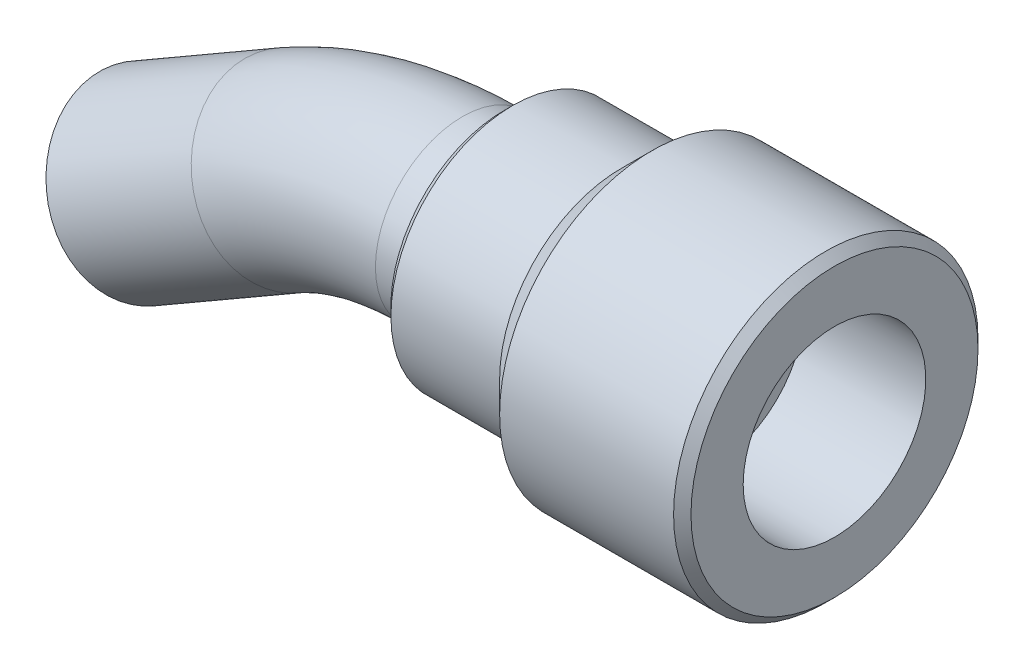
ISO-10303-21;
HEADER;
FILE_DESCRIPTION(('STEP AP214'),'2;1');
FILE_NAME('part.step','',(''),(''),'','','');
FILE_SCHEMA(('AUTOMOTIVE_DESIGN { 1 0 10303 214 1 1 1 1 }'));
ENDSEC;
DATA;
#1=APPLICATION_CONTEXT('core data for automotive mechanical design processes');
#2=APPLICATION_PROTOCOL_DEFINITION('international standard','automotive_design',2000,#1);
#3=PRODUCT_CONTEXT('',#1,'mechanical');
#4=PRODUCT('Part','Part','',(#3));
#5=PRODUCT_RELATED_PRODUCT_CATEGORY('part','',(#4));
#6=PRODUCT_DEFINITION_FORMATION('','',#4);
#7=PRODUCT_DEFINITION_CONTEXT('part definition',#1,'design');
#8=PRODUCT_DEFINITION('design','',#6,#7);
#9=PRODUCT_DEFINITION_SHAPE('','',#8);
#10=(LENGTH_UNIT() NAMED_UNIT(*) SI_UNIT(.MILLI.,.METRE.));
#11=(NAMED_UNIT(*) PLANE_ANGLE_UNIT() SI_UNIT($,.RADIAN.));
#12=(NAMED_UNIT(*) SI_UNIT($,.STERADIAN.) SOLID_ANGLE_UNIT());
#13=UNCERTAINTY_MEASURE_WITH_UNIT(LENGTH_MEASURE(1.E-05),#10,'distance_accuracy_value','');
#14=(GEOMETRIC_REPRESENTATION_CONTEXT(3) GLOBAL_UNCERTAINTY_ASSIGNED_CONTEXT((#13)) GLOBAL_UNIT_ASSIGNED_CONTEXT((#10,
#11,#12)) REPRESENTATION_CONTEXT('',''));
#15=CARTESIAN_POINT('',(0.,0.,0.));
#16=DIRECTION('',(0.,0.,1.));
#17=DIRECTION('',(1.,0.,0.));
#18=AXIS2_PLACEMENT_3D('',#15,#16,#17);
#19=CARTESIAN_POINT('',(0.,10.,0.));
#20=DIRECTION('',(1.,0.,0.));
#21=DIRECTION('',(0.,0.,-1.));
#22=AXIS2_PLACEMENT_3D('',#19,#20,#21);
#23=PLANE('',#22);
#24=CARTESIAN_POINT('',(0.,0.,0.));
#25=DIRECTION('',(1.,0.,0.));
#26=DIRECTION('',(0.,0.,-1.));
#27=AXIS2_PLACEMENT_3D('',#24,#25,#26);
#28=CIRCLE('',#27,13.);
#29=CARTESIAN_POINT('',(0.,0.,-13.));
#30=VERTEX_POINT('',#29);
#31=EDGE_CURVE('E41',#30,#30,#28,.F.);
#32=ORIENTED_EDGE('',*,*,#31,.T.);
#33=EDGE_LOOP('',(#32));
#34=FACE_BOUND('',#33,.T.);
#35=CARTESIAN_POINT('',(0.,0.,0.));
#36=DIRECTION('',(-1.,0.,0.));
#37=DIRECTION('',(0.,0.,1.));
#38=AXIS2_PLACEMENT_3D('',#35,#36,#37);
#39=CIRCLE('',#38,10.);
#40=CARTESIAN_POINT('',(0.,0.,10.));
#41=VERTEX_POINT('',#40);
#42=EDGE_CURVE('E54',#41,#41,#39,.T.);
#43=ORIENTED_EDGE('',*,*,#42,.F.);
#44=EDGE_LOOP('',(#43));
#45=FACE_BOUND('',#44,.T.);
#46=ADVANCED_FACE('F33',(#34,#45),#23,.F.);
#47=CARTESIAN_POINT('',(0.,0.,0.));
#48=DIRECTION('',(-1.,0.,0.));
#49=DIRECTION('',(0.,0.,1.));
#50=AXIS2_PLACEMENT_3D('',#47,#48,#49);
#51=CYLINDRICAL_SURFACE('',#50,14.);
#52=CARTESIAN_POINT('',(1.,0.,0.));
#53=DIRECTION('',(1.,0.,0.));
#54=DIRECTION('',(0.,0.,-1.));
#55=AXIS2_PLACEMENT_3D('',#52,#53,#54);
#56=CIRCLE('',#55,14.);
#57=CARTESIAN_POINT('',(1.,0.,-14.));
#58=VERTEX_POINT('',#57);
#59=EDGE_CURVE('E10',#58,#58,#56,.T.);
#60=ORIENTED_EDGE('',*,*,#59,.T.);
#61=EDGE_LOOP('',(#60));
#62=FACE_BOUND('',#61,.T.);
#63=CARTESIAN_POINT('',(13.5,0.,0.));
#64=DIRECTION('',(-1.,0.,0.));
#65=DIRECTION('',(0.,0.,1.));
#66=AXIS2_PLACEMENT_3D('',#63,#64,#65);
#67=CIRCLE('',#66,14.);
#68=CARTESIAN_POINT('',(13.5,0.,14.));
#69=VERTEX_POINT('',#68);
#70=EDGE_CURVE('E57',#69,#69,#67,.T.);
#71=ORIENTED_EDGE('',*,*,#70,.T.);
#72=EDGE_LOOP('',(#71));
#73=FACE_BOUND('',#72,.T.);
#74=ADVANCED_FACE('F110',(#62,#73),#51,.T.);
#75=CARTESIAN_POINT('',(17.,0.,0.));
#76=DIRECTION('',(1.,0.,0.));
#77=DIRECTION('',(0.,0.,-1.));
#78=AXIS2_PLACEMENT_3D('',#75,#76,#77);
#79=CONICAL_SURFACE('',#78,17.5,0.78539816339745);
#80=ORIENTED_EDGE('',*,*,#70,.F.);
#81=EDGE_LOOP('',(#80));
#82=FACE_BOUND('',#81,.T.);
#83=CARTESIAN_POINT('',(17.,0.,0.));
#84=DIRECTION('',(-1.,0.,0.));
#85=DIRECTION('',(0.,0.,1.));
#86=AXIS2_PLACEMENT_3D('',#83,#84,#85);
#87=CIRCLE('',#86,17.5);
#88=CARTESIAN_POINT('',(17.,0.,17.5));
#89=VERTEX_POINT('',#88);
#90=EDGE_CURVE('E60',#89,#89,#87,.T.);
#91=ORIENTED_EDGE('',*,*,#90,.T.);
#92=EDGE_LOOP('',(#91));
#93=FACE_BOUND('',#92,.T.);
#94=ADVANCED_FACE('F115',(#82,#93),#79,.T.);
#95=CARTESIAN_POINT('',(0.,0.,0.));
#96=DIRECTION('',(-1.,0.,0.));
#97=DIRECTION('',(0.,0.,1.));
#98=AXIS2_PLACEMENT_3D('',#95,#96,#97);
#99=CYLINDRICAL_SURFACE('',#98,17.5);
#100=CARTESIAN_POINT('',(37.,0.,0.));
#101=DIRECTION('',(-1.,0.,0.));
#102=DIRECTION('',(0.,0.,1.));
#103=AXIS2_PLACEMENT_3D('',#100,#101,#102);
#104=CIRCLE('',#103,17.5);
#105=CARTESIAN_POINT('',(37.,0.,17.5));
#106=VERTEX_POINT('',#105);
#107=EDGE_CURVE('E49',#106,#106,#104,.T.);
#108=ORIENTED_EDGE('',*,*,#107,.T.);
#109=EDGE_LOOP('',(#108));
#110=FACE_BOUND('',#109,.T.);
#111=ORIENTED_EDGE('',*,*,#90,.F.);
#112=EDGE_LOOP('',(#111));
#113=FACE_BOUND('',#112,.T.);
#114=ADVANCED_FACE('F126',(#110,#113),#99,.T.);
#115=CARTESIAN_POINT('',(38.,17.5,0.));
#116=DIRECTION('',(-1.,0.,0.));
#117=DIRECTION('',(0.,0.,1.));
#118=AXIS2_PLACEMENT_3D('',#115,#116,#117);
#119=PLANE('',#118);
#120=CARTESIAN_POINT('',(38.,0.,0.));
#121=DIRECTION('',(-1.,0.,0.));
#122=DIRECTION('',(0.,0.,1.));
#123=AXIS2_PLACEMENT_3D('',#120,#121,#122);
#124=CIRCLE('',#123,16.5);
#125=CARTESIAN_POINT('',(38.,0.,16.5));
#126=VERTEX_POINT('',#125);
#127=EDGE_CURVE('E45',#126,#126,#124,.F.);
#128=ORIENTED_EDGE('',*,*,#127,.T.);
#129=EDGE_LOOP('',(#128));
#130=FACE_BOUND('',#129,.T.);
#131=CARTESIAN_POINT('',(38.,0.,0.));
#132=DIRECTION('',(-1.,0.,0.));
#133=DIRECTION('',(0.,0.,1.));
#134=AXIS2_PLACEMENT_3D('',#131,#132,#133);
#135=CIRCLE('',#134,10.5);
#136=CARTESIAN_POINT('',(38.,0.,10.5));
#137=VERTEX_POINT('',#136);
#138=EDGE_CURVE('E63',#137,#137,#135,.T.);
#139=ORIENTED_EDGE('',*,*,#138,.T.);
#140=EDGE_LOOP('',(#139));
#141=FACE_BOUND('',#140,.T.);
#142=ADVANCED_FACE('F130',(#130,#141),#119,.F.);
#143=CARTESIAN_POINT('',(0.,0.,0.));
#144=DIRECTION('',(-1.,0.,0.));
#145=DIRECTION('',(0.,0.,1.));
#146=AXIS2_PLACEMENT_3D('',#143,#144,#145);
#147=CYLINDRICAL_SURFACE('',#146,10.5);
#148=ORIENTED_EDGE('',*,*,#138,.F.);
#149=EDGE_LOOP('',(#148));
#150=FACE_BOUND('',#149,.T.);
#151=CARTESIAN_POINT('',(24.,0.,0.));
#152=DIRECTION('',(-1.,0.,0.));
#153=DIRECTION('',(0.,0.,1.));
#154=AXIS2_PLACEMENT_3D('',#151,#152,#153);
#155=CIRCLE('',#154,10.5);
#156=CARTESIAN_POINT('',(24.,0.,10.5));
#157=VERTEX_POINT('',#156);
#158=EDGE_CURVE('E66',#157,#157,#155,.T.);
#159=ORIENTED_EDGE('',*,*,#158,.T.);
#160=EDGE_LOOP('',(#159));
#161=FACE_BOUND('',#160,.T.);
#162=ADVANCED_FACE('F104',(#150,#161),#147,.F.);
#163=CARTESIAN_POINT('',(24.,10.5,0.));
#164=DIRECTION('',(-1.,0.,0.));
#165=DIRECTION('',(0.,0.,1.));
#166=AXIS2_PLACEMENT_3D('',#163,#164,#165);
#167=PLANE('',#166);
#168=ORIENTED_EDGE('',*,*,#158,.F.);
#169=EDGE_LOOP('',(#168));
#170=FACE_BOUND('',#169,.T.);
#171=CARTESIAN_POINT('',(24.,0.,0.));
#172=DIRECTION('',(-1.,0.,0.));
#173=DIRECTION('',(0.,0.,1.));
#174=AXIS2_PLACEMENT_3D('',#171,#172,#173);
#175=CIRCLE('',#174,6.);
#176=CARTESIAN_POINT('',(24.,0.,6.));
#177=VERTEX_POINT('',#176);
#178=EDGE_CURVE('E69',#177,#177,#175,.T.);
#179=ORIENTED_EDGE('',*,*,#178,.T.);
#180=EDGE_LOOP('',(#179));
#181=FACE_BOUND('',#180,.T.);
#182=ADVANCED_FACE('F96',(#170,#181),#167,.F.);
#183=CARTESIAN_POINT('',(0.,0.,0.));
#184=DIRECTION('',(-1.,0.,0.));
#185=DIRECTION('',(0.,0.,1.));
#186=AXIS2_PLACEMENT_3D('',#183,#184,#185);
#187=CYLINDRICAL_SURFACE('',#186,6.);
#188=ORIENTED_EDGE('',*,*,#178,.F.);
#189=EDGE_LOOP('',(#188));
#190=FACE_BOUND('',#189,.T.);
#191=CARTESIAN_POINT('',(-4.78203230275507,0.,0.));
#192=DIRECTION('',(-1.,0.,0.));
#193=DIRECTION('',(0.,0.,1.));
#194=AXIS2_PLACEMENT_3D('',#191,#192,#193);
#195=CIRCLE('',#194,6.);
#196=CARTESIAN_POINT('',(-4.78203230275507,6.,0.));
#197=VERTEX_POINT('',#196);
#198=EDGE_CURVE('E82',#197,#197,#195,.F.);
#199=ORIENTED_EDGE('',*,*,#198,.F.);
#200=EDGE_LOOP('',(#199));
#201=FACE_BOUND('',#200,.T.);
#202=ADVANCED_FACE('F93',(#190,#201),#187,.F.);
#203=CARTESIAN_POINT('',(37.,0.,0.));
#204=DIRECTION('',(-1.,0.,0.));
#205=DIRECTION('',(0.,0.,1.));
#206=AXIS2_PLACEMENT_3D('',#203,#204,#205);
#207=CONICAL_SURFACE('',#206,17.5,0.785398163397452);
#208=ORIENTED_EDGE('',*,*,#127,.F.);
#209=EDGE_LOOP('',(#208));
#210=FACE_BOUND('',#209,.T.);
#211=ORIENTED_EDGE('',*,*,#107,.F.);
#212=EDGE_LOOP('',(#211));
#213=FACE_BOUND('',#212,.T.);
#214=ADVANCED_FACE('F95',(#210,#213),#207,.T.);
#215=CARTESIAN_POINT('',(0.,0.,0.));
#216=DIRECTION('',(1.,0.,0.));
#217=DIRECTION('',(0.,0.,-1.));
#218=AXIS2_PLACEMENT_3D('',#215,#216,#217);
#219=CONICAL_SURFACE('',#218,13.,0.785398163397444);
#220=ORIENTED_EDGE('',*,*,#59,.F.);
#221=EDGE_LOOP('',(#220));
#222=FACE_BOUND('',#221,.T.);
#223=ORIENTED_EDGE('',*,*,#31,.F.);
#224=EDGE_LOOP('',(#223));
#225=FACE_BOUND('',#224,.T.);
#226=ADVANCED_FACE('F36',(#222,#225),#219,.T.);
#227=CARTESIAN_POINT('',(14.5,0.,0.));
#228=DIRECTION('',(-1.,0.,0.));
#229=DIRECTION('',(0.,-1.,0.));
#230=AXIS2_PLACEMENT_3D('',#227,#228,#229);
#231=CYLINDRICAL_SURFACE('',#230,10.);
#232=CARTESIAN_POINT('',(-4.78203230275507,0.,0.));
#233=DIRECTION('',(-1.,0.,0.));
#234=DIRECTION('',(0.,0.,1.));
#235=AXIS2_PLACEMENT_3D('',#232,#233,#234);
#236=CIRCLE('',#235,10.);
#237=CARTESIAN_POINT('',(-4.78203230275508,9.99999999999999,0.));
#238=VERTEX_POINT('',#237);
#239=EDGE_CURVE('E77',#238,#238,#236,.T.);
#240=ORIENTED_EDGE('',*,*,#239,.F.);
#241=EDGE_LOOP('',(#240));
#242=FACE_BOUND('',#241,.T.);
#243=ORIENTED_EDGE('',*,*,#42,.T.);
#244=EDGE_LOOP('',(#243));
#245=FACE_BOUND('',#244,.T.);
#246=ADVANCED_FACE('F187',(#242,#245),#231,.T.);
#247=CARTESIAN_POINT('',(-4.78203230275505,-40.,0.));
#248=DIRECTION('',(0.,0.,1.));
#249=DIRECTION('',(1.,0.,0.));
#250=AXIS2_PLACEMENT_3D('',#247,#248,#249);
#251=TOROIDAL_SURFACE('',#250,40.,10.);
#252=CARTESIAN_POINT('',(-24.7820323027551,-5.3589838486225,0.));
#253=DIRECTION('',(-0.866025403784438,-0.500000000000002,0.));
#254=DIRECTION('',(0.,0.,1.));
#255=AXIS2_PLACEMENT_3D('',#252,#253,#254);
#256=CIRCLE('',#255,10.);
#257=CARTESIAN_POINT('',(-29.7820323027551,3.30127018922188,0.));
#258=VERTEX_POINT('',#257);
#259=EDGE_CURVE('E73',#258,#258,#256,.T.);
#260=CARTESIAN_POINT('',(-4.78203230275505,-40.,0.));
#261=DIRECTION('',(0.,0.,1.));
#262=DIRECTION('',(1.,0.,0.));
#263=AXIS2_PLACEMENT_3D('',#260,#261,#262);
#264=CIRCLE('',#263,50.);
#265=EDGE_CURVE('',#238,#258,#264,.T.);
#266=ORIENTED_EDGE('',*,*,#239,.T.);
#267=ORIENTED_EDGE('',*,*,#259,.F.);
#268=ORIENTED_EDGE('',*,*,#265,.T.);
#269=ORIENTED_EDGE('',*,*,#265,.F.);
#270=EDGE_LOOP('',(#266,#268,#267,#269));
#271=FACE_BOUND('',#270,.T.);
#272=ADVANCED_FACE('F201',(#271),#251,.T.);
#273=CARTESIAN_POINT('',(-24.7820323027551,-5.3589838486225,0.));
#274=DIRECTION('',(-0.866025403784438,-0.500000000000001,0.));
#275=DIRECTION('',(0.500000000000001,-0.866025403784438,0.));
#276=AXIS2_PLACEMENT_3D('',#273,#274,#275);
#277=CYLINDRICAL_SURFACE('',#276,10.);
#278=CARTESIAN_POINT('',(-41.4807621135331,-15.,0.));
#279=DIRECTION('',(-0.866025403784438,-0.500000000000001,0.));
#280=DIRECTION('',(0.,0.,1.));
#281=AXIS2_PLACEMENT_3D('',#278,#279,#280);
#282=CIRCLE('',#281,10.);
#283=CARTESIAN_POINT('',(-41.4807621135331,-15.,10.));
#284=VERTEX_POINT('',#283);
#285=EDGE_CURVE('E76',#284,#284,#282,.T.);
#286=ORIENTED_EDGE('',*,*,#285,.F.);
#287=EDGE_LOOP('',(#286));
#288=FACE_BOUND('',#287,.T.);
#289=ORIENTED_EDGE('',*,*,#259,.T.);
#290=EDGE_LOOP('',(#289));
#291=FACE_BOUND('',#290,.T.);
#292=ADVANCED_FACE('F212',(#288,#291),#277,.T.);
#293=CARTESIAN_POINT('',(-41.4807621135331,-15.,0.));
#294=DIRECTION('',(-0.866025403784438,-0.500000000000001,0.));
#295=DIRECTION('',(0.,0.,1.));
#296=AXIS2_PLACEMENT_3D('',#293,#294,#295);
#297=PLANE('',#296);
#298=CARTESIAN_POINT('',(-41.4807621135331,-15.,0.));
#299=DIRECTION('',(-0.866025403784438,-0.500000000000001,0.));
#300=DIRECTION('',(0.,0.,1.));
#301=AXIS2_PLACEMENT_3D('',#298,#299,#300);
#302=CIRCLE('',#301,6.);
#303=CARTESIAN_POINT('',(-41.4807621135331,-15.,6.));
#304=VERTEX_POINT('',#303);
#305=EDGE_CURVE('E72',#304,#304,#302,.F.);
#306=ORIENTED_EDGE('',*,*,#305,.T.);
#307=EDGE_LOOP('',(#306));
#308=FACE_BOUND('',#307,.T.);
#309=ORIENTED_EDGE('',*,*,#285,.T.);
#310=EDGE_LOOP('',(#309));
#311=FACE_BOUND('',#310,.T.);
#312=ADVANCED_FACE('F222',(#308,#311),#297,.T.);
#313=CARTESIAN_POINT('',(-4.78203230275505,-40.,0.));
#314=DIRECTION('',(0.,0.,1.));
#315=DIRECTION('',(1.,0.,0.));
#316=AXIS2_PLACEMENT_3D('',#313,#314,#315);
#317=TOROIDAL_SURFACE('',#316,40.,6.);
#318=CARTESIAN_POINT('',(-24.7820323027551,-5.3589838486225,0.));
#319=DIRECTION('',(-0.866025403784438,-0.500000000000002,0.));
#320=DIRECTION('',(0.,0.,1.));
#321=AXIS2_PLACEMENT_3D('',#318,#319,#320);
#322=CIRCLE('',#321,6.);
#323=CARTESIAN_POINT('',(-27.7820323027551,-0.162831425915874,0.));
#324=VERTEX_POINT('',#323);
#325=EDGE_CURVE('E85',#324,#324,#322,.F.);
#326=CARTESIAN_POINT('',(-4.78203230275505,-40.,0.));
#327=DIRECTION('',(0.,0.,1.));
#328=DIRECTION('',(1.,0.,0.));
#329=AXIS2_PLACEMENT_3D('',#326,#327,#328);
#330=CIRCLE('',#329,46.);
#331=EDGE_CURVE('',#197,#324,#330,.T.);
#332=ORIENTED_EDGE('',*,*,#198,.T.);
#333=ORIENTED_EDGE('',*,*,#325,.F.);
#334=ORIENTED_EDGE('',*,*,#331,.T.);
#335=ORIENTED_EDGE('',*,*,#331,.F.);
#336=EDGE_LOOP('',(#332,#334,#333,#335));
#337=FACE_BOUND('',#336,.T.);
#338=ADVANCED_FACE('F91',(#337),#317,.F.);
#339=CARTESIAN_POINT('',(-24.7820323027551,-5.3589838486225,0.));
#340=DIRECTION('',(-0.866025403784438,-0.500000000000001,0.));
#341=DIRECTION('',(0.500000000000001,-0.866025403784438,0.));
#342=AXIS2_PLACEMENT_3D('',#339,#340,#341);
#343=CYLINDRICAL_SURFACE('',#342,6.);
#344=ORIENTED_EDGE('',*,*,#305,.F.);
#345=EDGE_LOOP('',(#344));
#346=FACE_BOUND('',#345,.T.);
#347=ORIENTED_EDGE('',*,*,#325,.T.);
#348=EDGE_LOOP('',(#347));
#349=FACE_BOUND('',#348,.T.);
#350=ADVANCED_FACE('F204',(#346,#349),#343,.F.);
#351=CLOSED_SHELL('',(#46,#74,#94,#114,#142,#162,#182,#202,#214,#226,#246,#272,#292,#312,#338,#350));
#352=MANIFOLD_SOLID_BREP('B2',#351);
#353=ADVANCED_BREP_SHAPE_REPRESENTATION('',(#18,#352),#14);
#354=SHAPE_DEFINITION_REPRESENTATION(#9,#353);
ENDSEC;
END-ISO-10303-21;
